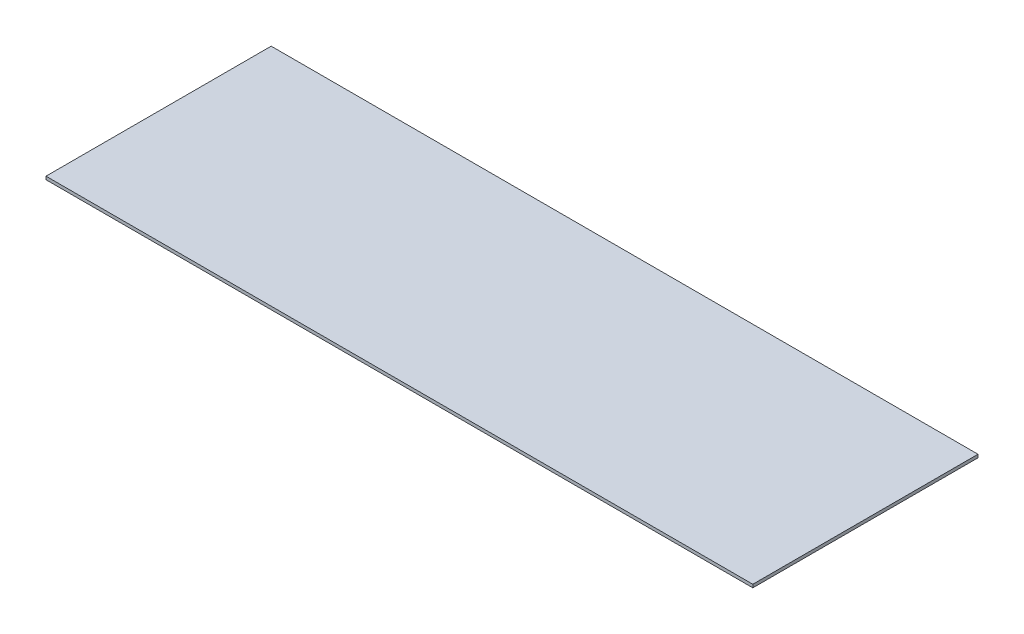
ISO-10303-21;
HEADER;
FILE_DESCRIPTION(('STEP AP214'),'2;1');
FILE_NAME('part.step','',(''),(''),'','','');
FILE_SCHEMA(('AUTOMOTIVE_DESIGN { 1 0 10303 214 1 1 1 1 }'));
ENDSEC;
DATA;
#1=APPLICATION_CONTEXT('core data for automotive mechanical design processes');
#2=APPLICATION_PROTOCOL_DEFINITION('international standard','automotive_design',2000,#1);
#3=PRODUCT_CONTEXT('',#1,'mechanical');
#4=PRODUCT('Part','Part','',(#3));
#5=PRODUCT_RELATED_PRODUCT_CATEGORY('part','',(#4));
#6=PRODUCT_DEFINITION_FORMATION('','',#4);
#7=PRODUCT_DEFINITION_CONTEXT('part definition',#1,'design');
#8=PRODUCT_DEFINITION('design','',#6,#7);
#9=PRODUCT_DEFINITION_SHAPE('','',#8);
#10=(LENGTH_UNIT() NAMED_UNIT(*) SI_UNIT(.MILLI.,.METRE.));
#11=(NAMED_UNIT(*) PLANE_ANGLE_UNIT() SI_UNIT($,.RADIAN.));
#12=(NAMED_UNIT(*) SI_UNIT($,.STERADIAN.) SOLID_ANGLE_UNIT());
#13=UNCERTAINTY_MEASURE_WITH_UNIT(LENGTH_MEASURE(1.E-05),#10,'distance_accuracy_value','');
#14=(GEOMETRIC_REPRESENTATION_CONTEXT(3) GLOBAL_UNCERTAINTY_ASSIGNED_CONTEXT((#13)) GLOBAL_UNIT_ASSIGNED_CONTEXT((#10,
#11,#12)) REPRESENTATION_CONTEXT('',''));
#15=CARTESIAN_POINT('',(0.,0.,0.));
#16=DIRECTION('',(0.,0.,1.));
#17=DIRECTION('',(1.,0.,0.));
#18=AXIS2_PLACEMENT_3D('',#15,#16,#17);
#19=CARTESIAN_POINT('',(-1087.64871435823,5.,-331.739130434783));
#20=DIRECTION('',(1.,0.,0.));
#21=DIRECTION('',(0.,0.,-1.));
#22=AXIS2_PLACEMENT_3D('',#19,#20,#21);
#23=PLANE('',#22);
#24=DIRECTION('',(0.,0.,1.));
#25=VECTOR('',#24,1.);
#26=CARTESIAN_POINT('',(-1087.64871435823,0.,-331.739130434783));
#27=LINE('',#26,#25);
#28=CARTESIAN_POINT('',(-1087.64871435823,0.,-331.739130434783));
#29=VERTEX_POINT('',#28);
#30=CARTESIAN_POINT('',(-1087.64871435823,0.,28.2608695652174));
#31=VERTEX_POINT('',#30);
#32=EDGE_CURVE('E109',#29,#31,#27,.T.);
#33=ORIENTED_EDGE('',*,*,#32,.T.);
#34=DIRECTION('',(0.,-1.,0.));
#35=VECTOR('',#34,1.);
#36=CARTESIAN_POINT('',(-1087.64871435823,5.,28.2608695652174));
#37=LINE('',#36,#35);
#38=CARTESIAN_POINT('',(-1087.64871435823,5.,28.2608695652174));
#39=VERTEX_POINT('',#38);
#40=EDGE_CURVE('E11',#39,#31,#37,.T.);
#41=ORIENTED_EDGE('',*,*,#40,.F.);
#42=DIRECTION('',(0.,0.,1.));
#43=VECTOR('',#42,1.);
#44=CARTESIAN_POINT('',(-1087.64871435823,5.,-331.739130434783));
#45=LINE('',#44,#43);
#46=CARTESIAN_POINT('',(-1087.64871435823,5.,-331.739130434783));
#47=VERTEX_POINT('',#46);
#48=EDGE_CURVE('E93',#47,#39,#45,.T.);
#49=ORIENTED_EDGE('',*,*,#48,.F.);
#50=DIRECTION('',(0.,-1.,0.));
#51=VECTOR('',#50,1.);
#52=CARTESIAN_POINT('',(-1087.64871435823,5.,-331.739130434783));
#53=LINE('',#52,#51);
#54=EDGE_CURVE('E105',#47,#29,#53,.T.);
#55=ORIENTED_EDGE('',*,*,#54,.T.);
#56=EDGE_LOOP('',(#33,#41,#49,#55));
#57=FACE_BOUND('',#56,.T.);
#58=ADVANCED_FACE('F41',(#57),#23,.F.);
#59=CARTESIAN_POINT('',(-1087.64871435823,5.,28.2608695652174));
#60=DIRECTION('',(0.,0.,-1.));
#61=DIRECTION('',(-1.,0.,0.));
#62=AXIS2_PLACEMENT_3D('',#59,#60,#61);
#63=PLANE('',#62);
#64=DIRECTION('',(1.,0.,0.));
#65=VECTOR('',#64,1.);
#66=CARTESIAN_POINT('',(-1087.64871435823,0.,28.2608695652174));
#67=LINE('',#66,#65);
#68=CARTESIAN_POINT('',(42.351285641768,0.,28.2608695652174));
#69=VERTEX_POINT('',#68);
#70=EDGE_CURVE('E98',#31,#69,#67,.T.);
#71=ORIENTED_EDGE('',*,*,#70,.T.);
#72=DIRECTION('',(0.,-1.,0.));
#73=VECTOR('',#72,1.);
#74=CARTESIAN_POINT('',(42.351285641768,5.,28.2608695652174));
#75=LINE('',#74,#73);
#76=CARTESIAN_POINT('',(42.351285641768,5.,28.2608695652174));
#77=VERTEX_POINT('',#76);
#78=EDGE_CURVE('E50',#77,#69,#75,.T.);
#79=ORIENTED_EDGE('',*,*,#78,.F.);
#80=DIRECTION('',(1.,0.,0.));
#81=VECTOR('',#80,1.);
#82=CARTESIAN_POINT('',(-1087.64871435823,5.,28.2608695652174));
#83=LINE('',#82,#81);
#84=EDGE_CURVE('E88',#39,#77,#83,.T.);
#85=ORIENTED_EDGE('',*,*,#84,.F.);
#86=ORIENTED_EDGE('',*,*,#40,.T.);
#87=EDGE_LOOP('',(#71,#79,#85,#86));
#88=FACE_BOUND('',#87,.T.);
#89=ADVANCED_FACE('F97',(#88),#63,.F.);
#90=CARTESIAN_POINT('',(42.351285641768,5.,-331.739130434783));
#91=DIRECTION('',(-1.,0.,0.));
#92=DIRECTION('',(0.,0.,1.));
#93=AXIS2_PLACEMENT_3D('',#90,#91,#92);
#94=PLANE('',#93);
#95=DIRECTION('',(0.,0.,-1.));
#96=VECTOR('',#95,1.);
#97=CARTESIAN_POINT('',(42.351285641768,0.,-331.739130434783));
#98=LINE('',#97,#96);
#99=CARTESIAN_POINT('',(42.351285641768,0.,-331.739130434783));
#100=VERTEX_POINT('',#99);
#101=EDGE_CURVE('E75',#69,#100,#98,.T.);
#102=ORIENTED_EDGE('',*,*,#101,.T.);
#103=DIRECTION('',(0.,-1.,0.));
#104=VECTOR('',#103,1.);
#105=CARTESIAN_POINT('',(42.351285641768,5.,-331.739130434783));
#106=LINE('',#105,#104);
#107=CARTESIAN_POINT('',(42.351285641768,5.,-331.739130434783));
#108=VERTEX_POINT('',#107);
#109=EDGE_CURVE('E100',#108,#100,#106,.T.);
#110=ORIENTED_EDGE('',*,*,#109,.F.);
#111=DIRECTION('',(0.,0.,-1.));
#112=VECTOR('',#111,1.);
#113=CARTESIAN_POINT('',(42.351285641768,5.,-331.739130434783));
#114=LINE('',#113,#112);
#115=EDGE_CURVE('E91',#77,#108,#114,.T.);
#116=ORIENTED_EDGE('',*,*,#115,.F.);
#117=ORIENTED_EDGE('',*,*,#78,.T.);
#118=EDGE_LOOP('',(#102,#110,#116,#117));
#119=FACE_BOUND('',#118,.T.);
#120=ADVANCED_FACE('F101',(#119),#94,.F.);
#121=CARTESIAN_POINT('',(-1087.64871435823,5.,-331.739130434783));
#122=DIRECTION('',(0.,0.,1.));
#123=DIRECTION('',(1.,0.,0.));
#124=AXIS2_PLACEMENT_3D('',#121,#122,#123);
#125=PLANE('',#124);
#126=DIRECTION('',(-1.,0.,0.));
#127=VECTOR('',#126,1.);
#128=CARTESIAN_POINT('',(-1087.64871435823,0.,-331.739130434783));
#129=LINE('',#128,#127);
#130=EDGE_CURVE('E81',#100,#29,#129,.T.);
#131=ORIENTED_EDGE('',*,*,#130,.T.);
#132=ORIENTED_EDGE('',*,*,#54,.F.);
#133=DIRECTION('',(-1.,0.,0.));
#134=VECTOR('',#133,1.);
#135=CARTESIAN_POINT('',(-1087.64871435823,5.,-331.739130434783));
#136=LINE('',#135,#134);
#137=EDGE_CURVE('E58',#108,#47,#136,.T.);
#138=ORIENTED_EDGE('',*,*,#137,.F.);
#139=ORIENTED_EDGE('',*,*,#109,.T.);
#140=EDGE_LOOP('',(#131,#132,#138,#139));
#141=FACE_BOUND('',#140,.T.);
#142=ADVANCED_FACE('F122',(#141),#125,.F.);
#143=CARTESIAN_POINT('',(0.,5.,0.));
#144=DIRECTION('',(0.,1.,0.));
#145=DIRECTION('',(0.,0.,1.));
#146=AXIS2_PLACEMENT_3D('',#143,#144,#145);
#147=PLANE('',#146);
#148=ORIENTED_EDGE('',*,*,#48,.T.);
#149=ORIENTED_EDGE('',*,*,#84,.T.);
#150=ORIENTED_EDGE('',*,*,#115,.T.);
#151=ORIENTED_EDGE('',*,*,#137,.T.);
#152=EDGE_LOOP('',(#148,#149,#150,#151));
#153=FACE_BOUND('',#152,.T.);
#154=ADVANCED_FACE('F89',(#153),#147,.T.);
#155=CARTESIAN_POINT('',(0.,0.,0.));
#156=DIRECTION('',(0.,1.,0.));
#157=DIRECTION('',(0.,0.,1.));
#158=AXIS2_PLACEMENT_3D('',#155,#156,#157);
#159=PLANE('',#158);
#160=ORIENTED_EDGE('',*,*,#32,.F.);
#161=ORIENTED_EDGE('',*,*,#130,.F.);
#162=ORIENTED_EDGE('',*,*,#101,.F.);
#163=ORIENTED_EDGE('',*,*,#70,.F.);
#164=EDGE_LOOP('',(#160,#161,#162,#163));
#165=FACE_BOUND('',#164,.T.);
#166=ADVANCED_FACE('F125',(#165),#159,.F.);
#167=CLOSED_SHELL('',(#58,#89,#120,#142,#154,#166));
#168=MANIFOLD_SOLID_BREP('B2',#167);
#169=ADVANCED_BREP_SHAPE_REPRESENTATION('',(#18,#168),#14);
#170=SHAPE_DEFINITION_REPRESENTATION(#9,#169);
ENDSEC;
END-ISO-10303-21;
